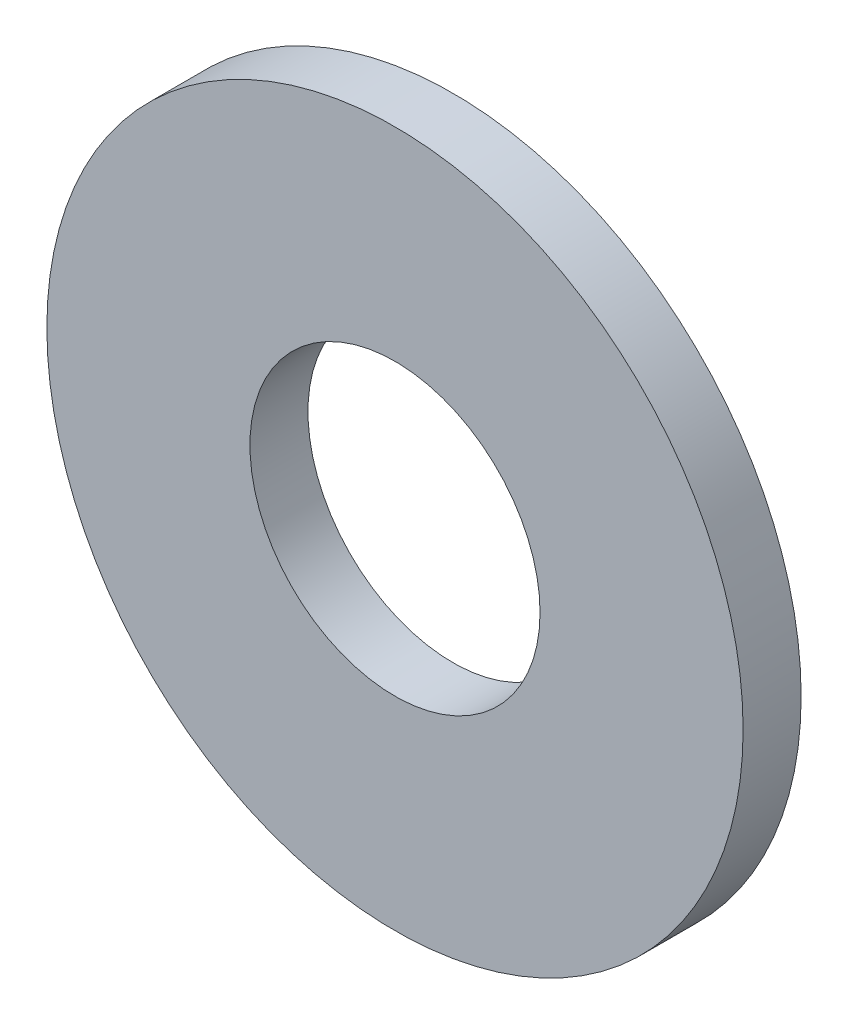
ISO-10303-21;
HEADER;
FILE_DESCRIPTION(('STEP AP214'),'2;1');
FILE_NAME('part.step','',(''),(''),'','','');
FILE_SCHEMA(('AUTOMOTIVE_DESIGN { 1 0 10303 214 1 1 1 1 }'));
ENDSEC;
DATA;
#1=APPLICATION_CONTEXT('core data for automotive mechanical design processes');
#2=APPLICATION_PROTOCOL_DEFINITION('international standard','automotive_design',2000,#1);
#3=PRODUCT_CONTEXT('',#1,'mechanical');
#4=PRODUCT('Part','Part','',(#3));
#5=PRODUCT_RELATED_PRODUCT_CATEGORY('part','',(#4));
#6=PRODUCT_DEFINITION_FORMATION('','',#4);
#7=PRODUCT_DEFINITION_CONTEXT('part definition',#1,'design');
#8=PRODUCT_DEFINITION('design','',#6,#7);
#9=PRODUCT_DEFINITION_SHAPE('','',#8);
#10=(LENGTH_UNIT() NAMED_UNIT(*) SI_UNIT(.MILLI.,.METRE.));
#11=(NAMED_UNIT(*) PLANE_ANGLE_UNIT() SI_UNIT($,.RADIAN.));
#12=(NAMED_UNIT(*) SI_UNIT($,.STERADIAN.) SOLID_ANGLE_UNIT());
#13=UNCERTAINTY_MEASURE_WITH_UNIT(LENGTH_MEASURE(1.E-05),#10,'distance_accuracy_value','');
#14=(GEOMETRIC_REPRESENTATION_CONTEXT(3) GLOBAL_UNCERTAINTY_ASSIGNED_CONTEXT((#13)) GLOBAL_UNIT_ASSIGNED_CONTEXT((#10,
#11,#12)) REPRESENTATION_CONTEXT('',''));
#15=CARTESIAN_POINT('',(0.,0.,0.));
#16=DIRECTION('',(0.,0.,1.));
#17=DIRECTION('',(1.,0.,0.));
#18=AXIS2_PLACEMENT_3D('',#15,#16,#17);
#19=CARTESIAN_POINT('',(0.,0.,1.));
#20=DIRECTION('',(0.,0.,1.));
#21=DIRECTION('',(1.,0.,0.));
#22=AXIS2_PLACEMENT_3D('',#19,#20,#21);
#23=PLANE('',#22);
#24=CARTESIAN_POINT('',(0.,0.,1.));
#25=DIRECTION('',(0.,0.,1.));
#26=DIRECTION('',(1.,0.,0.));
#27=AXIS2_PLACEMENT_3D('',#24,#25,#26);
#28=CIRCLE('',#27,6.);
#29=CARTESIAN_POINT('',(6.,0.,1.));
#30=VERTEX_POINT('',#29);
#31=EDGE_CURVE('E10',#30,#30,#28,.T.);
#32=ORIENTED_EDGE('',*,*,#31,.T.);
#33=EDGE_LOOP('',(#32));
#34=FACE_BOUND('',#33,.T.);
#35=CARTESIAN_POINT('',(0.,0.,1.));
#36=DIRECTION('',(0.,0.,1.));
#37=DIRECTION('',(1.,0.,0.));
#38=AXIS2_PLACEMENT_3D('',#35,#36,#37);
#39=CIRCLE('',#38,2.5);
#40=CARTESIAN_POINT('',(2.5,0.,1.));
#41=VERTEX_POINT('',#40);
#42=EDGE_CURVE('E40',#41,#41,#39,.T.);
#43=ORIENTED_EDGE('',*,*,#42,.F.);
#44=EDGE_LOOP('',(#43));
#45=FACE_BOUND('',#44,.T.);
#46=ADVANCED_FACE('F29',(#34,#45),#23,.T.);
#47=CARTESIAN_POINT('',(0.,0.,0.));
#48=DIRECTION('',(0.,0.,1.));
#49=DIRECTION('',(1.,0.,0.));
#50=AXIS2_PLACEMENT_3D('',#47,#48,#49);
#51=PLANE('',#50);
#52=CARTESIAN_POINT('',(0.,0.,0.));
#53=DIRECTION('',(0.,0.,1.));
#54=DIRECTION('',(1.,0.,0.));
#55=AXIS2_PLACEMENT_3D('',#52,#53,#54);
#56=CIRCLE('',#55,6.);
#57=CARTESIAN_POINT('',(6.,0.,0.));
#58=VERTEX_POINT('',#57);
#59=EDGE_CURVE('E33',#58,#58,#56,.T.);
#60=ORIENTED_EDGE('',*,*,#59,.F.);
#61=EDGE_LOOP('',(#60));
#62=FACE_BOUND('',#61,.T.);
#63=CARTESIAN_POINT('',(0.,0.,0.));
#64=DIRECTION('',(0.,0.,1.));
#65=DIRECTION('',(1.,0.,0.));
#66=AXIS2_PLACEMENT_3D('',#63,#64,#65);
#67=CIRCLE('',#66,2.5);
#68=CARTESIAN_POINT('',(2.5,0.,0.));
#69=VERTEX_POINT('',#68);
#70=EDGE_CURVE('E42',#69,#69,#67,.T.);
#71=ORIENTED_EDGE('',*,*,#70,.T.);
#72=EDGE_LOOP('',(#71));
#73=FACE_BOUND('',#72,.T.);
#74=ADVANCED_FACE('F52',(#62,#73),#51,.F.);
#75=CARTESIAN_POINT('',(0.,0.,1.));
#76=DIRECTION('',(0.,0.,-1.));
#77=DIRECTION('',(-1.,0.,0.));
#78=AXIS2_PLACEMENT_3D('',#75,#76,#77);
#79=CYLINDRICAL_SURFACE('',#78,6.);
#80=ORIENTED_EDGE('',*,*,#31,.F.);
#81=EDGE_LOOP('',(#80));
#82=FACE_BOUND('',#81,.T.);
#83=ORIENTED_EDGE('',*,*,#59,.T.);
#84=EDGE_LOOP('',(#83));
#85=FACE_BOUND('',#84,.T.);
#86=ADVANCED_FACE('F31',(#82,#85),#79,.T.);
#87=CARTESIAN_POINT('',(0.,0.,1.));
#88=DIRECTION('',(0.,0.,-1.));
#89=DIRECTION('',(-1.,0.,0.));
#90=AXIS2_PLACEMENT_3D('',#87,#88,#89);
#91=CYLINDRICAL_SURFACE('',#90,2.5);
#92=ORIENTED_EDGE('',*,*,#42,.T.);
#93=EDGE_LOOP('',(#92));
#94=FACE_BOUND('',#93,.T.);
#95=ORIENTED_EDGE('',*,*,#70,.F.);
#96=EDGE_LOOP('',(#95));
#97=FACE_BOUND('',#96,.T.);
#98=ADVANCED_FACE('F48',(#94,#97),#91,.F.);
#99=CLOSED_SHELL('',(#46,#74,#86,#98));
#100=MANIFOLD_SOLID_BREP('B2',#99);
#101=ADVANCED_BREP_SHAPE_REPRESENTATION('',(#18,#100),#14);
#102=SHAPE_DEFINITION_REPRESENTATION(#9,#101);
ENDSEC;
END-ISO-10303-21;
